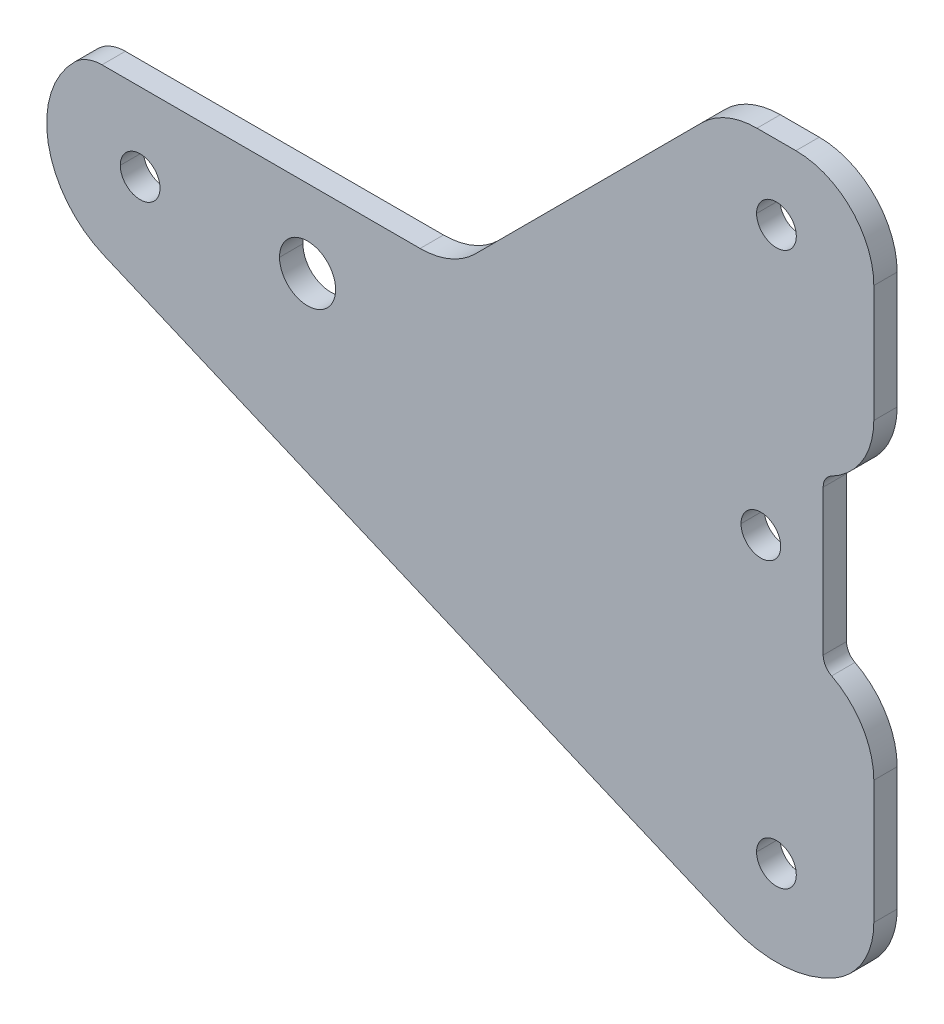
ISO-10303-21;
HEADER;
FILE_DESCRIPTION(('STEP AP214'),'2;1');
FILE_NAME('part.step','',(''),(''),'','','');
FILE_SCHEMA(('AUTOMOTIVE_DESIGN { 1 0 10303 214 1 1 1 1 }'));
ENDSEC;
DATA;
#1=APPLICATION_CONTEXT('core data for automotive mechanical design processes');
#2=APPLICATION_PROTOCOL_DEFINITION('international standard','automotive_design',2000,#1);
#3=PRODUCT_CONTEXT('',#1,'mechanical');
#4=PRODUCT('Part','Part','',(#3));
#5=PRODUCT_RELATED_PRODUCT_CATEGORY('part','',(#4));
#6=PRODUCT_DEFINITION_FORMATION('','',#4);
#7=PRODUCT_DEFINITION_CONTEXT('part definition',#1,'design');
#8=PRODUCT_DEFINITION('design','',#6,#7);
#9=PRODUCT_DEFINITION_SHAPE('','',#8);
#10=(LENGTH_UNIT() NAMED_UNIT(*) SI_UNIT(.MILLI.,.METRE.));
#11=(NAMED_UNIT(*) PLANE_ANGLE_UNIT() SI_UNIT($,.RADIAN.));
#12=(NAMED_UNIT(*) SI_UNIT($,.STERADIAN.) SOLID_ANGLE_UNIT());
#13=UNCERTAINTY_MEASURE_WITH_UNIT(LENGTH_MEASURE(1.E-05),#10,'distance_accuracy_value','');
#14=(GEOMETRIC_REPRESENTATION_CONTEXT(3) GLOBAL_UNCERTAINTY_ASSIGNED_CONTEXT((#13)) GLOBAL_UNIT_ASSIGNED_CONTEXT((#10,
#11,#12)) REPRESENTATION_CONTEXT('',''));
#15=CARTESIAN_POINT('',(0.,0.,0.));
#16=DIRECTION('',(0.,0.,1.));
#17=DIRECTION('',(1.,0.,0.));
#18=AXIS2_PLACEMENT_3D('',#15,#16,#17);
#19=CARTESIAN_POINT('',(0.,35.5,-3.));
#20=DIRECTION('',(0.,0.,1.));
#21=DIRECTION('',(1.,0.,0.));
#22=AXIS2_PLACEMENT_3D('',#19,#20,#21);
#23=CYLINDRICAL_SURFACE('',#22,2.55);
#24=DIRECTION('',(0.,0.,1.));
#25=VECTOR('',#24,1.);
#26=CARTESIAN_POINT('',(-2.55,35.5,-3.));
#27=LINE('',#26,#25);
#28=CARTESIAN_POINT('',(-2.55,35.5,-3.));
#29=VERTEX_POINT('',#28);
#30=CARTESIAN_POINT('',(-2.55,35.5,0.));
#31=VERTEX_POINT('',#30);
#32=EDGE_CURVE('E515',#29,#31,#27,.T.);
#33=ORIENTED_EDGE('',*,*,#32,.F.);
#34=CARTESIAN_POINT('',(0.,35.5,-3.));
#35=DIRECTION('',(0.,0.,1.));
#36=DIRECTION('',(1.,0.,0.));
#37=AXIS2_PLACEMENT_3D('',#34,#35,#36);
#38=CIRCLE('',#37,2.55);
#39=CARTESIAN_POINT('',(2.55,35.5,-3.));
#40=VERTEX_POINT('',#39);
#41=EDGE_CURVE('E265',#40,#29,#38,.T.);
#42=ORIENTED_EDGE('',*,*,#41,.F.);
#43=DIRECTION('',(0.,0.,1.));
#44=VECTOR('',#43,1.);
#45=CARTESIAN_POINT('',(2.55,35.5,-3.));
#46=LINE('',#45,#44);
#47=CARTESIAN_POINT('',(2.55,35.5,0.));
#48=VERTEX_POINT('',#47);
#49=EDGE_CURVE('E514',#40,#48,#46,.T.);
#50=ORIENTED_EDGE('',*,*,#49,.T.);
#51=CARTESIAN_POINT('',(0.,35.5,0.));
#52=DIRECTION('',(0.,0.,1.));
#53=DIRECTION('',(1.,0.,0.));
#54=AXIS2_PLACEMENT_3D('',#51,#52,#53);
#55=CIRCLE('',#54,2.55);
#56=EDGE_CURVE('E270',#48,#31,#55,.T.);
#57=ORIENTED_EDGE('',*,*,#56,.T.);
#58=EDGE_LOOP('',(#33,#42,#50,#57));
#59=FACE_BOUND('',#58,.T.);
#60=ADVANCED_FACE('F17',(#59),#23,.F.);
#61=CARTESIAN_POINT('',(-2.,0.,-3.));
#62=DIRECTION('',(0.,0.,1.));
#63=DIRECTION('',(1.,0.,0.));
#64=AXIS2_PLACEMENT_3D('',#61,#62,#63);
#65=CYLINDRICAL_SURFACE('',#64,2.55);
#66=DIRECTION('',(0.,0.,1.));
#67=VECTOR('',#66,1.);
#68=CARTESIAN_POINT('',(-4.55,0.,-3.));
#69=LINE('',#68,#67);
#70=CARTESIAN_POINT('',(-4.55,0.,-3.));
#71=VERTEX_POINT('',#70);
#72=CARTESIAN_POINT('',(-4.55,0.,0.));
#73=VERTEX_POINT('',#72);
#74=EDGE_CURVE('E479',#71,#73,#69,.T.);
#75=ORIENTED_EDGE('',*,*,#74,.F.);
#76=CARTESIAN_POINT('',(-2.,0.,-3.));
#77=DIRECTION('',(0.,0.,1.));
#78=DIRECTION('',(1.,0.,0.));
#79=AXIS2_PLACEMENT_3D('',#76,#77,#78);
#80=CIRCLE('',#79,2.55);
#81=CARTESIAN_POINT('',(0.55,0.,-3.));
#82=VERTEX_POINT('',#81);
#83=EDGE_CURVE('E269',#82,#71,#80,.T.);
#84=ORIENTED_EDGE('',*,*,#83,.F.);
#85=DIRECTION('',(0.,0.,1.));
#86=VECTOR('',#85,1.);
#87=CARTESIAN_POINT('',(0.55,0.,-3.));
#88=LINE('',#87,#86);
#89=CARTESIAN_POINT('',(0.55,0.,0.));
#90=VERTEX_POINT('',#89);
#91=EDGE_CURVE('E478',#82,#90,#88,.T.);
#92=ORIENTED_EDGE('',*,*,#91,.T.);
#93=CARTESIAN_POINT('',(-2.,0.,0.));
#94=DIRECTION('',(0.,0.,1.));
#95=DIRECTION('',(1.,0.,0.));
#96=AXIS2_PLACEMENT_3D('',#93,#94,#95);
#97=CIRCLE('',#96,2.55);
#98=EDGE_CURVE('E274',#90,#73,#97,.T.);
#99=ORIENTED_EDGE('',*,*,#98,.T.);
#100=EDGE_LOOP('',(#75,#84,#92,#99));
#101=FACE_BOUND('',#100,.T.);
#102=ADVANCED_FACE('F567',(#101),#65,.F.);
#103=CARTESIAN_POINT('',(-81.7,0.,-3.));
#104=DIRECTION('',(0.,0.,1.));
#105=DIRECTION('',(1.,0.,0.));
#106=AXIS2_PLACEMENT_3D('',#103,#104,#105);
#107=CYLINDRICAL_SURFACE('',#106,2.55);
#108=DIRECTION('',(0.,0.,1.));
#109=VECTOR('',#108,1.);
#110=CARTESIAN_POINT('',(-84.25,0.,-3.));
#111=LINE('',#110,#109);
#112=CARTESIAN_POINT('',(-84.25,0.,-3.));
#113=VERTEX_POINT('',#112);
#114=CARTESIAN_POINT('',(-84.25,0.,0.));
#115=VERTEX_POINT('',#114);
#116=EDGE_CURVE('E480',#113,#115,#111,.T.);
#117=ORIENTED_EDGE('',*,*,#116,.F.);
#118=CARTESIAN_POINT('',(-81.7,0.,-3.));
#119=DIRECTION('',(0.,0.,1.));
#120=DIRECTION('',(1.,0.,0.));
#121=AXIS2_PLACEMENT_3D('',#118,#119,#120);
#122=CIRCLE('',#121,2.55);
#123=CARTESIAN_POINT('',(-79.15,0.,-3.));
#124=VERTEX_POINT('',#123);
#125=EDGE_CURVE('E322',#124,#113,#122,.T.);
#126=ORIENTED_EDGE('',*,*,#125,.F.);
#127=DIRECTION('',(0.,0.,1.));
#128=VECTOR('',#127,1.);
#129=CARTESIAN_POINT('',(-79.15,0.,-3.));
#130=LINE('',#129,#128);
#131=CARTESIAN_POINT('',(-79.15,0.,0.));
#132=VERTEX_POINT('',#131);
#133=EDGE_CURVE('E308',#124,#132,#130,.T.);
#134=ORIENTED_EDGE('',*,*,#133,.T.);
#135=CARTESIAN_POINT('',(-81.7,0.,0.));
#136=DIRECTION('',(0.,0.,1.));
#137=DIRECTION('',(1.,0.,0.));
#138=AXIS2_PLACEMENT_3D('',#135,#136,#137);
#139=CIRCLE('',#138,2.55);
#140=EDGE_CURVE('E276',#132,#115,#139,.T.);
#141=ORIENTED_EDGE('',*,*,#140,.T.);
#142=EDGE_LOOP('',(#117,#126,#134,#141));
#143=FACE_BOUND('',#142,.T.);
#144=ADVANCED_FACE('F918',(#143),#107,.F.);
#145=CARTESIAN_POINT('',(-60.2,0.,-3.));
#146=DIRECTION('',(0.,0.,1.));
#147=DIRECTION('',(1.,0.,0.));
#148=AXIS2_PLACEMENT_3D('',#145,#146,#147);
#149=CYLINDRICAL_SURFACE('',#148,3.6);
#150=DIRECTION('',(0.,0.,1.));
#151=VECTOR('',#150,1.);
#152=CARTESIAN_POINT('',(-63.8,0.,-3.));
#153=LINE('',#152,#151);
#154=CARTESIAN_POINT('',(-63.8,0.,-3.));
#155=VERTEX_POINT('',#154);
#156=CARTESIAN_POINT('',(-63.8,0.,0.));
#157=VERTEX_POINT('',#156);
#158=EDGE_CURVE('E289',#155,#157,#153,.T.);
#159=ORIENTED_EDGE('',*,*,#158,.F.);
#160=CARTESIAN_POINT('',(-60.2,0.,-3.));
#161=DIRECTION('',(0.,0.,1.));
#162=DIRECTION('',(1.,0.,0.));
#163=AXIS2_PLACEMENT_3D('',#160,#161,#162);
#164=CIRCLE('',#163,3.6);
#165=CARTESIAN_POINT('',(-56.6,0.,-3.));
#166=VERTEX_POINT('',#165);
#167=EDGE_CURVE('E369',#166,#155,#164,.T.);
#168=ORIENTED_EDGE('',*,*,#167,.F.);
#169=DIRECTION('',(0.,0.,1.));
#170=VECTOR('',#169,1.);
#171=CARTESIAN_POINT('',(-56.6,0.,-3.));
#172=LINE('',#171,#170);
#173=CARTESIAN_POINT('',(-56.6,0.,0.));
#174=VERTEX_POINT('',#173);
#175=EDGE_CURVE('E292',#166,#174,#172,.T.);
#176=ORIENTED_EDGE('',*,*,#175,.T.);
#177=CARTESIAN_POINT('',(-60.2,0.,0.));
#178=DIRECTION('',(0.,0.,1.));
#179=DIRECTION('',(1.,0.,0.));
#180=AXIS2_PLACEMENT_3D('',#177,#178,#179);
#181=CIRCLE('',#180,3.6);
#182=EDGE_CURVE('E25',#174,#157,#181,.T.);
#183=ORIENTED_EDGE('',*,*,#182,.T.);
#184=EDGE_LOOP('',(#159,#168,#176,#183));
#185=FACE_BOUND('',#184,.T.);
#186=ADVANCED_FACE('F286',(#185),#149,.F.);
#187=CARTESIAN_POINT('',(0.,-35.5,-3.));
#188=DIRECTION('',(0.,0.,1.));
#189=DIRECTION('',(1.,0.,0.));
#190=AXIS2_PLACEMENT_3D('',#187,#188,#189);
#191=CYLINDRICAL_SURFACE('',#190,2.55);
#192=DIRECTION('',(0.,0.,1.));
#193=VECTOR('',#192,1.);
#194=CARTESIAN_POINT('',(-2.55,-35.5,-3.));
#195=LINE('',#194,#193);
#196=CARTESIAN_POINT('',(-2.55,-35.5,-3.));
#197=VERTEX_POINT('',#196);
#198=CARTESIAN_POINT('',(-2.55,-35.5,0.));
#199=VERTEX_POINT('',#198);
#200=EDGE_CURVE('E318',#197,#199,#195,.T.);
#201=ORIENTED_EDGE('',*,*,#200,.F.);
#202=CARTESIAN_POINT('',(0.,-35.5,-3.));
#203=DIRECTION('',(0.,0.,1.));
#204=DIRECTION('',(-1.,0.,0.));
#205=AXIS2_PLACEMENT_3D('',#202,#203,#204);
#206=CIRCLE('',#205,2.55);
#207=CARTESIAN_POINT('',(2.55,-35.5,-3.));
#208=VERTEX_POINT('',#207);
#209=EDGE_CURVE('E275',#208,#197,#206,.T.);
#210=ORIENTED_EDGE('',*,*,#209,.F.);
#211=DIRECTION('',(0.,0.,1.));
#212=VECTOR('',#211,1.);
#213=CARTESIAN_POINT('',(2.55,-35.5,-3.));
#214=LINE('',#213,#212);
#215=CARTESIAN_POINT('',(2.55,-35.5,0.));
#216=VERTEX_POINT('',#215);
#217=EDGE_CURVE('E335',#208,#216,#214,.T.);
#218=ORIENTED_EDGE('',*,*,#217,.T.);
#219=CARTESIAN_POINT('',(0.,-35.5,0.));
#220=DIRECTION('',(0.,0.,1.));
#221=DIRECTION('',(-1.,0.,0.));
#222=AXIS2_PLACEMENT_3D('',#219,#220,#221);
#223=CIRCLE('',#222,2.55);
#224=EDGE_CURVE('E11',#216,#199,#223,.T.);
#225=ORIENTED_EDGE('',*,*,#224,.T.);
#226=EDGE_LOOP('',(#201,#210,#218,#225));
#227=FACE_BOUND('',#226,.T.);
#228=ADVANCED_FACE('F870',(#227),#191,.F.);
#229=CARTESIAN_POINT('',(2.49999999999994,35.,0.));
#230=DIRECTION('',(0.,0.,1.));
#231=DIRECTION('',(1.,0.,0.));
#232=AXIS2_PLACEMENT_3D('',#229,#230,#231);
#233=PLANE('',#232);
#234=ORIENTED_EDGE('',*,*,#224,.F.);
#235=CARTESIAN_POINT('',(0.,-35.5,0.));
#236=DIRECTION('',(0.,0.,1.));
#237=DIRECTION('',(-1.,0.,0.));
#238=AXIS2_PLACEMENT_3D('',#235,#236,#237);
#239=CIRCLE('',#238,2.55);
#240=EDGE_CURVE('E331',#199,#216,#239,.T.);
#241=ORIENTED_EDGE('',*,*,#240,.F.);
#242=EDGE_LOOP('',(#234,#241));
#243=FACE_BOUND('',#242,.T.);
#244=ORIENTED_EDGE('',*,*,#182,.F.);
#245=CARTESIAN_POINT('',(-60.2,0.,0.));
#246=DIRECTION('',(0.,0.,1.));
#247=DIRECTION('',(1.,0.,0.));
#248=AXIS2_PLACEMENT_3D('',#245,#246,#247);
#249=CIRCLE('',#248,3.6);
#250=EDGE_CURVE('E295',#157,#174,#249,.T.);
#251=ORIENTED_EDGE('',*,*,#250,.F.);
#252=EDGE_LOOP('',(#244,#251));
#253=FACE_BOUND('',#252,.T.);
#254=ORIENTED_EDGE('',*,*,#140,.F.);
#255=CARTESIAN_POINT('',(-81.7,0.,0.));
#256=DIRECTION('',(0.,0.,1.));
#257=DIRECTION('',(1.,0.,0.));
#258=AXIS2_PLACEMENT_3D('',#255,#256,#257);
#259=CIRCLE('',#258,2.55);
#260=EDGE_CURVE('E483',#115,#132,#259,.T.);
#261=ORIENTED_EDGE('',*,*,#260,.F.);
#262=EDGE_LOOP('',(#254,#261));
#263=FACE_BOUND('',#262,.T.);
#264=ORIENTED_EDGE('',*,*,#98,.F.);
#265=CARTESIAN_POINT('',(-2.,0.,0.));
#266=DIRECTION('',(0.,0.,1.));
#267=DIRECTION('',(1.,0.,0.));
#268=AXIS2_PLACEMENT_3D('',#265,#266,#267);
#269=CIRCLE('',#268,2.55);
#270=EDGE_CURVE('E475',#73,#90,#269,.T.);
#271=ORIENTED_EDGE('',*,*,#270,.F.);
#272=EDGE_LOOP('',(#264,#271));
#273=FACE_BOUND('',#272,.T.);
#274=ORIENTED_EDGE('',*,*,#56,.F.);
#275=CARTESIAN_POINT('',(0.,35.5,0.));
#276=DIRECTION('',(0.,0.,1.));
#277=DIRECTION('',(1.,0.,0.));
#278=AXIS2_PLACEMENT_3D('',#275,#276,#277);
#279=CIRCLE('',#278,2.55);
#280=EDGE_CURVE('E510',#31,#48,#279,.T.);
#281=ORIENTED_EDGE('',*,*,#280,.F.);
#282=EDGE_LOOP('',(#274,#281));
#283=FACE_BOUND('',#282,.T.);
#284=CARTESIAN_POINT('',(2.49999999999994,35.,0.));
#285=DIRECTION('',(0.,0.,1.));
#286=DIRECTION('',(1.,0.,0.));
#287=AXIS2_PLACEMENT_3D('',#284,#285,#286);
#288=CIRCLE('',#287,9.99999999999412);
#289=CARTESIAN_POINT('',(12.4999999999944,35.,0.));
#290=VERTEX_POINT('',#289);
#291=CARTESIAN_POINT('',(2.5,44.9999999999938,0.));
#292=VERTEX_POINT('',#291);
#293=EDGE_CURVE('E339',#290,#292,#288,.T.);
#294=ORIENTED_EDGE('',*,*,#293,.T.);
#295=DIRECTION('',(-1.,0.,0.));
#296=VECTOR('',#295,1.);
#297=CARTESIAN_POINT('',(-2.49999999999994,44.9999999999938,0.));
#298=LINE('',#297,#296);
#299=CARTESIAN_POINT('',(-2.49999999999994,44.9999999999969,0.));
#300=VERTEX_POINT('',#299);
#301=EDGE_CURVE('E52',#292,#300,#298,.T.);
#302=ORIENTED_EDGE('',*,*,#301,.T.);
#303=CARTESIAN_POINT('',(-2.5,35.,0.));
#304=DIRECTION('',(0.,0.,1.));
#305=DIRECTION('',(1.,0.,0.));
#306=AXIS2_PLACEMENT_3D('',#303,#304,#305);
#307=CIRCLE('',#306,9.99999999999692);
#308=CARTESIAN_POINT('',(-9.57522742713172,42.0669057482298,0.));
#309=VERTEX_POINT('',#308);
#310=EDGE_CURVE('E220',#300,#309,#307,.T.);
#311=ORIENTED_EDGE('',*,*,#310,.T.);
#312=DIRECTION('',(-0.706690574822978,-0.707522742713172,0.));
#313=VECTOR('',#312,1.);
#314=CARTESIAN_POINT('',(-38.6747725728683,12.9330942517702,0.));
#315=LINE('',#314,#313);
#316=CARTESIAN_POINT('',(-38.6747725728656,12.9330942517675,0.));
#317=VERTEX_POINT('',#316);
#318=EDGE_CURVE('E224',#309,#317,#315,.T.);
#319=ORIENTED_EDGE('',*,*,#318,.T.);
#320=CARTESIAN_POINT('',(-45.75,20.,0.));
#321=DIRECTION('',(0.,0.,-1.));
#322=DIRECTION('',(1.,0.,0.));
#323=AXIS2_PLACEMENT_3D('',#320,#321,#322);
#324=CIRCLE('',#323,10.0000000000038);
#325=CARTESIAN_POINT('',(-45.75,9.99999999999243,0.));
#326=VERTEX_POINT('',#325);
#327=EDGE_CURVE('E254',#317,#326,#324,.T.);
#328=ORIENTED_EDGE('',*,*,#327,.T.);
#329=DIRECTION('',(-1.,0.,0.));
#330=VECTOR('',#329,1.);
#331=CARTESIAN_POINT('',(-86.5989794855663,9.99999999999276,0.));
#332=LINE('',#331,#330);
#333=CARTESIAN_POINT('',(-86.5989794855663,9.99999999999638,0.));
#334=VERTEX_POINT('',#333);
#335=EDGE_CURVE('E452',#326,#334,#332,.T.);
#336=ORIENTED_EDGE('',*,*,#335,.T.);
#337=CARTESIAN_POINT('',(-86.5989794855664,5.,0.));
#338=DIRECTION('',(0.,0.,1.));
#339=DIRECTION('',(1.,0.,0.));
#340=AXIS2_PLACEMENT_3D('',#337,#338,#339);
#341=CIRCLE('',#340,4.99999999999638);
#342=CARTESIAN_POINT('',(-90.0982505466852,8.57142857142857,0.));
#343=VERTEX_POINT('',#342);
#344=EDGE_CURVE('E440',#334,#343,#341,.T.);
#345=ORIENTED_EDGE('',*,*,#344,.T.);
#346=CARTESIAN_POINT('',(-81.7,0.,0.));
#347=DIRECTION('',(0.,0.,1.));
#348=DIRECTION('',(1.,0.,0.));
#349=AXIS2_PLACEMENT_3D('',#346,#347,#348);
#350=CIRCLE('',#349,12.);
#351=CARTESIAN_POINT('',(-86.3980076205846,-11.0421340508495,0.));
#352=VERTEX_POINT('',#351);
#353=EDGE_CURVE('E377',#343,#352,#350,.T.);
#354=ORIENTED_EDGE('',*,*,#353,.T.);
#355=DIRECTION('',(0.92017783757079,-0.391500635048713,0.));
#356=VECTOR('',#355,1.);
#357=CARTESIAN_POINT('',(-86.3980076205846,-11.0421340508495,0.));
#358=LINE('',#357,#356);
#359=CARTESIAN_POINT('',(-5.8725095257307,-45.3026675635618,0.));
#360=VERTEX_POINT('',#359);
#361=EDGE_CURVE('E326',#352,#360,#358,.T.);
#362=ORIENTED_EDGE('',*,*,#361,.T.);
#363=CARTESIAN_POINT('',(0.,-31.5,0.));
#364=DIRECTION('',(0.,0.,1.));
#365=DIRECTION('',(1.,0.,0.));
#366=AXIS2_PLACEMENT_3D('',#363,#364,#365);
#367=CIRCLE('',#366,15.);
#368=CARTESIAN_POINT('',(7.49999999999869,-44.4903810567643,0.));
#369=VERTEX_POINT('',#368);
#370=EDGE_CURVE('E422',#360,#369,#367,.T.);
#371=ORIENTED_EDGE('',*,*,#370,.T.);
#372=CARTESIAN_POINT('',(2.5,-35.8301270189222,0.));
#373=DIRECTION('',(0.,0.,1.));
#374=DIRECTION('',(1.,0.,0.));
#375=AXIS2_PLACEMENT_3D('',#372,#373,#374);
#376=CIRCLE('',#375,9.99999999999738);
#377=CARTESIAN_POINT('',(12.4999999999948,-35.8301270189221,0.));
#378=VERTEX_POINT('',#377);
#379=EDGE_CURVE('E355',#369,#378,#376,.T.);
#380=ORIENTED_EDGE('',*,*,#379,.T.);
#381=DIRECTION('',(0.,1.,0.));
#382=VECTOR('',#381,1.);
#383=CARTESIAN_POINT('',(12.4999999999948,-35.8301270189221,0.));
#384=LINE('',#383,#382);
#385=CARTESIAN_POINT('',(12.499999999996,-20.,0.));
#386=VERTEX_POINT('',#385);
#387=EDGE_CURVE('E413',#378,#386,#384,.T.);
#388=ORIENTED_EDGE('',*,*,#387,.T.);
#389=CARTESIAN_POINT('',(2.5,-20.,0.));
#390=DIRECTION('',(0.,0.,1.));
#391=DIRECTION('',(-1.,0.,0.));
#392=AXIS2_PLACEMENT_3D('',#389,#390,#391);
#393=CIRCLE('',#392,9.999999999996);
#394=CARTESIAN_POINT('',(7.08333333333352,-11.1121962467906,0.));
#395=VERTEX_POINT('',#394);
#396=EDGE_CURVE('E406',#386,#395,#393,.T.);
#397=ORIENTED_EDGE('',*,*,#396,.T.);
#398=CARTESIAN_POINT('',(8.,-9.33463549614922,0.));
#399=DIRECTION('',(0.,0.,-1.));
#400=DIRECTION('',(1.,0.,0.));
#401=AXIS2_PLACEMENT_3D('',#398,#399,#400);
#402=CIRCLE('',#401,1.99999999999959);
#403=CARTESIAN_POINT('',(6.00000000000349,-9.33463549614922,0.));
#404=VERTEX_POINT('',#403);
#405=EDGE_CURVE('E384',#395,#404,#402,.T.);
#406=ORIENTED_EDGE('',*,*,#405,.T.);
#407=DIRECTION('',(0.,1.,0.));
#408=VECTOR('',#407,1.);
#409=CARTESIAN_POINT('',(6.00000000000349,-9.33463549614922,0.));
#410=LINE('',#409,#408);
#411=CARTESIAN_POINT('',(6.00000000000036,9.33463549614922,0.));
#412=VERTEX_POINT('',#411);
#413=EDGE_CURVE('E390',#404,#412,#410,.T.);
#414=ORIENTED_EDGE('',*,*,#413,.T.);
#415=CARTESIAN_POINT('',(8.,9.33463549614922,0.));
#416=DIRECTION('',(0.,0.,-1.));
#417=DIRECTION('',(1.,0.,0.));
#418=AXIS2_PLACEMENT_3D('',#415,#416,#417);
#419=CIRCLE('',#418,1.99999999999964);
#420=CARTESIAN_POINT('',(7.08333333333142,11.1121962467947,0.));
#421=VERTEX_POINT('',#420);
#422=EDGE_CURVE('E368',#412,#421,#419,.T.);
#423=ORIENTED_EDGE('',*,*,#422,.T.);
#424=CARTESIAN_POINT('',(2.5,20.,0.));
#425=DIRECTION('',(0.,0.,1.));
#426=DIRECTION('',(1.,0.,0.));
#427=AXIS2_PLACEMENT_3D('',#424,#425,#426);
#428=CIRCLE('',#427,9.99999999999584);
#429=CARTESIAN_POINT('',(12.4999999999944,20.,0.));
#430=VERTEX_POINT('',#429);
#431=EDGE_CURVE('E360',#421,#430,#428,.T.);
#432=ORIENTED_EDGE('',*,*,#431,.T.);
#433=DIRECTION('',(0.,1.,0.));
#434=VECTOR('',#433,1.);
#435=CARTESIAN_POINT('',(12.4999999999944,20.,0.));
#436=LINE('',#435,#434);
#437=EDGE_CURVE('E348',#430,#290,#436,.T.);
#438=ORIENTED_EDGE('',*,*,#437,.T.);
#439=EDGE_LOOP('',(#294,#302,#311,#319,#328,#336,#345,#354,#362,#371,#380,#388,#397,#406,#414,
#423,#432,#438));
#440=FACE_BOUND('',#439,.T.);
#441=ADVANCED_FACE('F222',(#243,#253,#263,#273,#283,#440),#233,.T.);
#442=CARTESIAN_POINT('',(2.49999999999994,35.,-3.));
#443=DIRECTION('',(0.,0.,1.));
#444=DIRECTION('',(1.,0.,0.));
#445=AXIS2_PLACEMENT_3D('',#442,#443,#444);
#446=PLANE('',#445);
#447=ORIENTED_EDGE('',*,*,#209,.T.);
#448=CARTESIAN_POINT('',(0.,-35.5,-3.));
#449=DIRECTION('',(0.,0.,1.));
#450=DIRECTION('',(-1.,0.,0.));
#451=AXIS2_PLACEMENT_3D('',#448,#449,#450);
#452=CIRCLE('',#451,2.55);
#453=EDGE_CURVE('E314',#197,#208,#452,.T.);
#454=ORIENTED_EDGE('',*,*,#453,.T.);
#455=EDGE_LOOP('',(#447,#454));
#456=FACE_BOUND('',#455,.T.);
#457=ORIENTED_EDGE('',*,*,#167,.T.);
#458=CARTESIAN_POINT('',(-60.2,0.,-3.));
#459=DIRECTION('',(0.,0.,1.));
#460=DIRECTION('',(1.,0.,0.));
#461=AXIS2_PLACEMENT_3D('',#458,#459,#460);
#462=CIRCLE('',#461,3.6);
#463=EDGE_CURVE('E302',#155,#166,#462,.T.);
#464=ORIENTED_EDGE('',*,*,#463,.T.);
#465=EDGE_LOOP('',(#457,#464));
#466=FACE_BOUND('',#465,.T.);
#467=ORIENTED_EDGE('',*,*,#125,.T.);
#468=CARTESIAN_POINT('',(-81.7,0.,-3.));
#469=DIRECTION('',(0.,0.,1.));
#470=DIRECTION('',(1.,0.,0.));
#471=AXIS2_PLACEMENT_3D('',#468,#469,#470);
#472=CIRCLE('',#471,2.55);
#473=EDGE_CURVE('E484',#113,#124,#472,.T.);
#474=ORIENTED_EDGE('',*,*,#473,.T.);
#475=EDGE_LOOP('',(#467,#474));
#476=FACE_BOUND('',#475,.T.);
#477=ORIENTED_EDGE('',*,*,#83,.T.);
#478=CARTESIAN_POINT('',(-2.,0.,-3.));
#479=DIRECTION('',(0.,0.,1.));
#480=DIRECTION('',(1.,0.,0.));
#481=AXIS2_PLACEMENT_3D('',#478,#479,#480);
#482=CIRCLE('',#481,2.55);
#483=EDGE_CURVE('E536',#71,#82,#482,.T.);
#484=ORIENTED_EDGE('',*,*,#483,.T.);
#485=EDGE_LOOP('',(#477,#484));
#486=FACE_BOUND('',#485,.T.);
#487=ORIENTED_EDGE('',*,*,#41,.T.);
#488=CARTESIAN_POINT('',(0.,35.5,-3.));
#489=DIRECTION('',(0.,0.,1.));
#490=DIRECTION('',(1.,0.,0.));
#491=AXIS2_PLACEMENT_3D('',#488,#489,#490);
#492=CIRCLE('',#491,2.55);
#493=EDGE_CURVE('E521',#29,#40,#492,.T.);
#494=ORIENTED_EDGE('',*,*,#493,.T.);
#495=EDGE_LOOP('',(#487,#494));
#496=FACE_BOUND('',#495,.T.);
#497=CARTESIAN_POINT('',(2.49999999999994,35.,-3.));
#498=DIRECTION('',(0.,0.,1.));
#499=DIRECTION('',(1.,0.,0.));
#500=AXIS2_PLACEMENT_3D('',#497,#498,#499);
#501=CIRCLE('',#500,9.99999999999412);
#502=CARTESIAN_POINT('',(12.4999999999944,35.,-3.));
#503=VERTEX_POINT('',#502);
#504=CARTESIAN_POINT('',(2.5,44.9999999999938,-3.));
#505=VERTEX_POINT('',#504);
#506=EDGE_CURVE('E311',#503,#505,#501,.T.);
#507=ORIENTED_EDGE('',*,*,#506,.F.);
#508=DIRECTION('',(0.,1.,0.));
#509=VECTOR('',#508,1.);
#510=CARTESIAN_POINT('',(12.4999999999944,20.,-3.));
#511=LINE('',#510,#509);
#512=CARTESIAN_POINT('',(12.4999999999944,20.,-3.));
#513=VERTEX_POINT('',#512);
#514=EDGE_CURVE('E357',#513,#503,#511,.T.);
#515=ORIENTED_EDGE('',*,*,#514,.F.);
#516=CARTESIAN_POINT('',(2.5,20.,-3.));
#517=DIRECTION('',(0.,0.,1.));
#518=DIRECTION('',(1.,0.,0.));
#519=AXIS2_PLACEMENT_3D('',#516,#517,#518);
#520=CIRCLE('',#519,9.99999999999584);
#521=CARTESIAN_POINT('',(7.08333333333142,11.1121962467947,-3.));
#522=VERTEX_POINT('',#521);
#523=EDGE_CURVE('E365',#522,#513,#520,.T.);
#524=ORIENTED_EDGE('',*,*,#523,.F.);
#525=CARTESIAN_POINT('',(8.,9.33463549614922,-3.));
#526=DIRECTION('',(0.,0.,-1.));
#527=DIRECTION('',(1.,0.,0.));
#528=AXIS2_PLACEMENT_3D('',#525,#526,#527);
#529=CIRCLE('',#528,1.99999999999964);
#530=CARTESIAN_POINT('',(6.00000000000036,9.33463549614922,-3.));
#531=VERTEX_POINT('',#530);
#532=EDGE_CURVE('E389',#531,#522,#529,.T.);
#533=ORIENTED_EDGE('',*,*,#532,.F.);
#534=DIRECTION('',(0.,1.,0.));
#535=VECTOR('',#534,1.);
#536=CARTESIAN_POINT('',(6.00000000000349,-9.33463549614922,-3.));
#537=LINE('',#536,#535);
#538=CARTESIAN_POINT('',(6.00000000000349,-9.33463549614922,-3.));
#539=VERTEX_POINT('',#538);
#540=EDGE_CURVE('E381',#539,#531,#537,.T.);
#541=ORIENTED_EDGE('',*,*,#540,.F.);
#542=CARTESIAN_POINT('',(8.,-9.33463549614922,-3.));
#543=DIRECTION('',(0.,0.,-1.));
#544=DIRECTION('',(1.,0.,0.));
#545=AXIS2_PLACEMENT_3D('',#542,#543,#544);
#546=CIRCLE('',#545,1.99999999999959);
#547=CARTESIAN_POINT('',(7.08333333333352,-11.1121962467906,-3.));
#548=VERTEX_POINT('',#547);
#549=EDGE_CURVE('E402',#548,#539,#546,.T.);
#550=ORIENTED_EDGE('',*,*,#549,.F.);
#551=CARTESIAN_POINT('',(2.5,-20.,-3.));
#552=DIRECTION('',(0.,0.,1.));
#553=DIRECTION('',(-1.,0.,0.));
#554=AXIS2_PLACEMENT_3D('',#551,#552,#553);
#555=CIRCLE('',#554,9.999999999996);
#556=CARTESIAN_POINT('',(12.499999999996,-20.,-3.));
#557=VERTEX_POINT('',#556);
#558=EDGE_CURVE('E410',#557,#548,#555,.T.);
#559=ORIENTED_EDGE('',*,*,#558,.F.);
#560=DIRECTION('',(0.,1.,0.));
#561=VECTOR('',#560,1.);
#562=CARTESIAN_POINT('',(12.4999999999948,-35.8301270189221,-3.));
#563=LINE('',#562,#561);
#564=CARTESIAN_POINT('',(12.4999999999948,-35.8301270189221,-3.));
#565=VERTEX_POINT('',#564);
#566=EDGE_CURVE('E352',#565,#557,#563,.T.);
#567=ORIENTED_EDGE('',*,*,#566,.F.);
#568=CARTESIAN_POINT('',(2.5,-35.8301270189222,-3.));
#569=DIRECTION('',(0.,0.,1.));
#570=DIRECTION('',(1.,0.,0.));
#571=AXIS2_PLACEMENT_3D('',#568,#569,#570);
#572=CIRCLE('',#571,9.99999999999738);
#573=CARTESIAN_POINT('',(7.49999999999869,-44.4903810567643,-3.));
#574=VERTEX_POINT('',#573);
#575=EDGE_CURVE('E419',#574,#565,#572,.T.);
#576=ORIENTED_EDGE('',*,*,#575,.F.);
#577=CARTESIAN_POINT('',(0.,-31.5,-3.));
#578=DIRECTION('',(0.,0.,1.));
#579=DIRECTION('',(1.,0.,0.));
#580=AXIS2_PLACEMENT_3D('',#577,#578,#579);
#581=CIRCLE('',#580,15.);
#582=CARTESIAN_POINT('',(-5.8725095257307,-45.3026675635618,-3.));
#583=VERTEX_POINT('',#582);
#584=EDGE_CURVE('E323',#583,#574,#581,.T.);
#585=ORIENTED_EDGE('',*,*,#584,.F.);
#586=DIRECTION('',(0.92017783757079,-0.391500635048713,0.));
#587=VECTOR('',#586,1.);
#588=CARTESIAN_POINT('',(-86.3980076205846,-11.0421340508495,-3.));
#589=LINE('',#588,#587);
#590=CARTESIAN_POINT('',(-86.3980076205846,-11.0421340508495,-3.));
#591=VERTEX_POINT('',#590);
#592=EDGE_CURVE('E433',#591,#583,#589,.T.);
#593=ORIENTED_EDGE('',*,*,#592,.F.);
#594=CARTESIAN_POINT('',(-81.7,0.,-3.));
#595=DIRECTION('',(0.,0.,1.));
#596=DIRECTION('',(1.,0.,0.));
#597=AXIS2_PLACEMENT_3D('',#594,#595,#596);
#598=CIRCLE('',#597,12.);
#599=CARTESIAN_POINT('',(-90.0982505466852,8.57142857142857,-3.));
#600=VERTEX_POINT('',#599);
#601=EDGE_CURVE('E376',#600,#591,#598,.T.);
#602=ORIENTED_EDGE('',*,*,#601,.F.);
#603=CARTESIAN_POINT('',(-86.5989794855664,5.,-3.));
#604=DIRECTION('',(0.,0.,1.));
#605=DIRECTION('',(1.,0.,0.));
#606=AXIS2_PLACEMENT_3D('',#603,#604,#605);
#607=CIRCLE('',#606,4.99999999999638);
#608=CARTESIAN_POINT('',(-86.5989794855663,9.99999999999638,-3.));
#609=VERTEX_POINT('',#608);
#610=EDGE_CURVE('E449',#609,#600,#607,.T.);
#611=ORIENTED_EDGE('',*,*,#610,.F.);
#612=DIRECTION('',(-1.,0.,0.));
#613=VECTOR('',#612,1.);
#614=CARTESIAN_POINT('',(-86.5989794855663,9.99999999999276,-3.));
#615=LINE('',#614,#613);
#616=CARTESIAN_POINT('',(-45.75,9.99999999999243,-3.));
#617=VERTEX_POINT('',#616);
#618=EDGE_CURVE('E453',#617,#609,#615,.T.);
#619=ORIENTED_EDGE('',*,*,#618,.F.);
#620=CARTESIAN_POINT('',(-45.75,20.,-3.));
#621=DIRECTION('',(0.,0.,-1.));
#622=DIRECTION('',(1.,0.,0.));
#623=AXIS2_PLACEMENT_3D('',#620,#621,#622);
#624=CIRCLE('',#623,10.0000000000038);
#625=CARTESIAN_POINT('',(-38.6747725728656,12.9330942517675,-3.));
#626=VERTEX_POINT('',#625);
#627=EDGE_CURVE('E245',#626,#617,#624,.T.);
#628=ORIENTED_EDGE('',*,*,#627,.F.);
#629=DIRECTION('',(-0.706690574822978,-0.707522742713172,0.));
#630=VECTOR('',#629,1.);
#631=CARTESIAN_POINT('',(-38.6747725728683,12.9330942517702,-3.));
#632=LINE('',#631,#630);
#633=CARTESIAN_POINT('',(-9.57522742713172,42.0669057482298,-3.));
#634=VERTEX_POINT('',#633);
#635=EDGE_CURVE('E230',#634,#626,#632,.T.);
#636=ORIENTED_EDGE('',*,*,#635,.F.);
#637=CARTESIAN_POINT('',(-2.5,35.,-3.));
#638=DIRECTION('',(0.,0.,1.));
#639=DIRECTION('',(1.,0.,0.));
#640=AXIS2_PLACEMENT_3D('',#637,#638,#639);
#641=CIRCLE('',#640,9.99999999999692);
#642=CARTESIAN_POINT('',(-2.49999999999994,44.9999999999969,-3.));
#643=VERTEX_POINT('',#642);
#644=EDGE_CURVE('E235',#643,#634,#641,.T.);
#645=ORIENTED_EDGE('',*,*,#644,.F.);
#646=DIRECTION('',(-1.,0.,0.));
#647=VECTOR('',#646,1.);
#648=CARTESIAN_POINT('',(-2.49999999999994,44.9999999999938,-3.));
#649=LINE('',#648,#647);
#650=EDGE_CURVE('E38',#505,#643,#649,.T.);
#651=ORIENTED_EDGE('',*,*,#650,.F.);
#652=EDGE_LOOP('',(#507,#515,#524,#533,#541,#550,#559,#567,#576,#585,#593,#602,#611,#619,#628,
#636,#645,#651));
#653=FACE_BOUND('',#652,.T.);
#654=ADVANCED_FACE('F616',(#456,#466,#476,#486,#496,#653),#446,.F.);
#655=CARTESIAN_POINT('',(-2.49999999999994,44.9999999999938,-3.));
#656=DIRECTION('',(0.,1.,0.));
#657=DIRECTION('',(1.,0.,0.));
#658=AXIS2_PLACEMENT_3D('',#655,#656,#657);
#659=PLANE('',#658);
#660=ORIENTED_EDGE('',*,*,#301,.F.);
#661=DIRECTION('',(0.,0.,1.));
#662=VECTOR('',#661,1.);
#663=CARTESIAN_POINT('',(2.5,44.9999999999938,-3.));
#664=LINE('',#663,#662);
#665=EDGE_CURVE('E344',#505,#292,#664,.T.);
#666=ORIENTED_EDGE('',*,*,#665,.F.);
#667=ORIENTED_EDGE('',*,*,#650,.T.);
#668=DIRECTION('',(0.,0.,1.));
#669=VECTOR('',#668,1.);
#670=CARTESIAN_POINT('',(-2.49999999999994,44.9999999999969,-3.));
#671=LINE('',#670,#669);
#672=EDGE_CURVE('E229',#643,#300,#671,.T.);
#673=ORIENTED_EDGE('',*,*,#672,.T.);
#674=EDGE_LOOP('',(#660,#666,#667,#673));
#675=FACE_BOUND('',#674,.T.);
#676=ADVANCED_FACE('F749',(#675),#659,.T.);
#677=CARTESIAN_POINT('',(-2.5,35.,-3.));
#678=DIRECTION('',(0.,0.,1.));
#679=DIRECTION('',(1.,0.,0.));
#680=AXIS2_PLACEMENT_3D('',#677,#678,#679);
#681=CYLINDRICAL_SURFACE('',#680,9.99999999999692);
#682=ORIENTED_EDGE('',*,*,#310,.F.);
#683=ORIENTED_EDGE('',*,*,#672,.F.);
#684=ORIENTED_EDGE('',*,*,#644,.T.);
#685=DIRECTION('',(0.,0.,1.));
#686=VECTOR('',#685,1.);
#687=CARTESIAN_POINT('',(-9.57522742713172,42.0669057482298,-3.));
#688=LINE('',#687,#686);
#689=EDGE_CURVE('E233',#634,#309,#688,.T.);
#690=ORIENTED_EDGE('',*,*,#689,.T.);
#691=EDGE_LOOP('',(#682,#683,#684,#690));
#692=FACE_BOUND('',#691,.T.);
#693=ADVANCED_FACE('F234',(#692),#681,.T.);
#694=CARTESIAN_POINT('',(-38.6747725728683,12.9330942517702,-3.));
#695=DIRECTION('',(-0.707522742713172,0.706690574822978,0.));
#696=DIRECTION('',(0.,0.,1.));
#697=AXIS2_PLACEMENT_3D('',#694,#695,#696);
#698=PLANE('',#697);
#699=ORIENTED_EDGE('',*,*,#318,.F.);
#700=ORIENTED_EDGE('',*,*,#689,.F.);
#701=ORIENTED_EDGE('',*,*,#635,.T.);
#702=DIRECTION('',(0.,0.,1.));
#703=VECTOR('',#702,1.);
#704=CARTESIAN_POINT('',(-38.6747725728656,12.9330942517675,-3.));
#705=LINE('',#704,#703);
#706=EDGE_CURVE('E242',#626,#317,#705,.T.);
#707=ORIENTED_EDGE('',*,*,#706,.T.);
#708=EDGE_LOOP('',(#699,#700,#701,#707));
#709=FACE_BOUND('',#708,.T.);
#710=ADVANCED_FACE('F240',(#709),#698,.T.);
#711=CARTESIAN_POINT('',(-45.75,20.,-3.));
#712=DIRECTION('',(0.,0.,1.));
#713=DIRECTION('',(1.,0.,0.));
#714=AXIS2_PLACEMENT_3D('',#711,#712,#713);
#715=CYLINDRICAL_SURFACE('',#714,10.0000000000038);
#716=ORIENTED_EDGE('',*,*,#327,.F.);
#717=ORIENTED_EDGE('',*,*,#706,.F.);
#718=ORIENTED_EDGE('',*,*,#627,.T.);
#719=DIRECTION('',(0.,0.,1.));
#720=VECTOR('',#719,1.);
#721=CARTESIAN_POINT('',(-45.75,9.99999999999243,-3.));
#722=LINE('',#721,#720);
#723=EDGE_CURVE('E455',#617,#326,#722,.T.);
#724=ORIENTED_EDGE('',*,*,#723,.T.);
#725=EDGE_LOOP('',(#716,#717,#718,#724));
#726=FACE_BOUND('',#725,.T.);
#727=ADVANCED_FACE('F657',(#726),#715,.F.);
#728=CARTESIAN_POINT('',(-86.5989794855663,9.99999999999276,-3.));
#729=DIRECTION('',(0.,1.,0.));
#730=DIRECTION('',(1.,0.,0.));
#731=AXIS2_PLACEMENT_3D('',#728,#729,#730);
#732=PLANE('',#731);
#733=ORIENTED_EDGE('',*,*,#335,.F.);
#734=ORIENTED_EDGE('',*,*,#723,.F.);
#735=ORIENTED_EDGE('',*,*,#618,.T.);
#736=DIRECTION('',(0.,0.,1.));
#737=VECTOR('',#736,1.);
#738=CARTESIAN_POINT('',(-86.5989794855663,9.99999999999638,-3.));
#739=LINE('',#738,#737);
#740=EDGE_CURVE('E445',#609,#334,#739,.T.);
#741=ORIENTED_EDGE('',*,*,#740,.T.);
#742=EDGE_LOOP('',(#733,#734,#735,#741));
#743=FACE_BOUND('',#742,.T.);
#744=ADVANCED_FACE('F656',(#743),#732,.T.);
#745=CARTESIAN_POINT('',(-86.5989794855664,5.,-3.));
#746=DIRECTION('',(0.,0.,1.));
#747=DIRECTION('',(1.,0.,0.));
#748=AXIS2_PLACEMENT_3D('',#745,#746,#747);
#749=CYLINDRICAL_SURFACE('',#748,4.99999999999638);
#750=ORIENTED_EDGE('',*,*,#344,.F.);
#751=ORIENTED_EDGE('',*,*,#740,.F.);
#752=ORIENTED_EDGE('',*,*,#610,.T.);
#753=DIRECTION('',(0.,0.,1.));
#754=VECTOR('',#753,1.);
#755=CARTESIAN_POINT('',(-90.0982505466852,8.57142857142857,-3.));
#756=LINE('',#755,#754);
#757=EDGE_CURVE('E372',#600,#343,#756,.T.);
#758=ORIENTED_EDGE('',*,*,#757,.T.);
#759=EDGE_LOOP('',(#750,#751,#752,#758));
#760=FACE_BOUND('',#759,.T.);
#761=ADVANCED_FACE('F653',(#760),#749,.T.);
#762=CARTESIAN_POINT('',(-81.7,0.,-3.));
#763=DIRECTION('',(0.,0.,1.));
#764=DIRECTION('',(1.,0.,0.));
#765=AXIS2_PLACEMENT_3D('',#762,#763,#764);
#766=CYLINDRICAL_SURFACE('',#765,12.);
#767=ORIENTED_EDGE('',*,*,#353,.F.);
#768=ORIENTED_EDGE('',*,*,#757,.F.);
#769=ORIENTED_EDGE('',*,*,#601,.T.);
#770=DIRECTION('',(0.,0.,1.));
#771=VECTOR('',#770,1.);
#772=CARTESIAN_POINT('',(-86.3980076205846,-11.0421340508495,-3.));
#773=LINE('',#772,#771);
#774=EDGE_CURVE('E429',#591,#352,#773,.T.);
#775=ORIENTED_EDGE('',*,*,#774,.T.);
#776=EDGE_LOOP('',(#767,#768,#769,#775));
#777=FACE_BOUND('',#776,.T.);
#778=ADVANCED_FACE('F650',(#777),#766,.T.);
#779=CARTESIAN_POINT('',(-86.3980076205846,-11.0421340508495,-3.));
#780=DIRECTION('',(-0.391500635048713,-0.92017783757079,0.));
#781=DIRECTION('',(-0.92017783757079,0.391500635048713,0.));
#782=AXIS2_PLACEMENT_3D('',#779,#780,#781);
#783=PLANE('',#782);
#784=ORIENTED_EDGE('',*,*,#361,.F.);
#785=ORIENTED_EDGE('',*,*,#774,.F.);
#786=ORIENTED_EDGE('',*,*,#592,.T.);
#787=DIRECTION('',(0.,0.,1.));
#788=VECTOR('',#787,1.);
#789=CARTESIAN_POINT('',(-5.8725095257307,-45.3026675635618,-3.));
#790=LINE('',#789,#788);
#791=EDGE_CURVE('E327',#583,#360,#790,.T.);
#792=ORIENTED_EDGE('',*,*,#791,.T.);
#793=EDGE_LOOP('',(#784,#785,#786,#792));
#794=FACE_BOUND('',#793,.T.);
#795=ADVANCED_FACE('F647',(#794),#783,.T.);
#796=CARTESIAN_POINT('',(0.,-31.5,-3.));
#797=DIRECTION('',(0.,0.,1.));
#798=DIRECTION('',(1.,0.,0.));
#799=AXIS2_PLACEMENT_3D('',#796,#797,#798);
#800=CYLINDRICAL_SURFACE('',#799,15.);
#801=ORIENTED_EDGE('',*,*,#370,.F.);
#802=ORIENTED_EDGE('',*,*,#791,.F.);
#803=ORIENTED_EDGE('',*,*,#584,.T.);
#804=DIRECTION('',(0.,0.,1.));
#805=VECTOR('',#804,1.);
#806=CARTESIAN_POINT('',(7.49999999999869,-44.4903810567643,-3.));
#807=LINE('',#806,#805);
#808=EDGE_CURVE('E423',#574,#369,#807,.T.);
#809=ORIENTED_EDGE('',*,*,#808,.T.);
#810=EDGE_LOOP('',(#801,#802,#803,#809));
#811=FACE_BOUND('',#810,.T.);
#812=ADVANCED_FACE('F639',(#811),#800,.T.);
#813=CARTESIAN_POINT('',(2.5,-35.8301270189222,-3.));
#814=DIRECTION('',(0.,0.,1.));
#815=DIRECTION('',(1.,0.,0.));
#816=AXIS2_PLACEMENT_3D('',#813,#814,#815);
#817=CYLINDRICAL_SURFACE('',#816,9.99999999999738);
#818=ORIENTED_EDGE('',*,*,#379,.F.);
#819=ORIENTED_EDGE('',*,*,#808,.F.);
#820=ORIENTED_EDGE('',*,*,#575,.T.);
#821=DIRECTION('',(0.,0.,1.));
#822=VECTOR('',#821,1.);
#823=CARTESIAN_POINT('',(12.4999999999948,-35.8301270189221,-3.));
#824=LINE('',#823,#822);
#825=EDGE_CURVE('E356',#565,#378,#824,.T.);
#826=ORIENTED_EDGE('',*,*,#825,.T.);
#827=EDGE_LOOP('',(#818,#819,#820,#826));
#828=FACE_BOUND('',#827,.T.);
#829=ADVANCED_FACE('F636',(#828),#817,.T.);
#830=CARTESIAN_POINT('',(12.4999999999948,-35.8301270189221,-3.));
#831=DIRECTION('',(1.,0.,0.));
#832=DIRECTION('',(0.,1.,0.));
#833=AXIS2_PLACEMENT_3D('',#830,#831,#832);
#834=PLANE('',#833);
#835=ORIENTED_EDGE('',*,*,#387,.F.);
#836=ORIENTED_EDGE('',*,*,#825,.F.);
#837=ORIENTED_EDGE('',*,*,#566,.T.);
#838=DIRECTION('',(0.,0.,1.));
#839=VECTOR('',#838,1.);
#840=CARTESIAN_POINT('',(12.499999999996,-20.,-3.));
#841=LINE('',#840,#839);
#842=EDGE_CURVE('E409',#557,#386,#841,.T.);
#843=ORIENTED_EDGE('',*,*,#842,.T.);
#844=EDGE_LOOP('',(#835,#836,#837,#843));
#845=FACE_BOUND('',#844,.T.);
#846=ADVANCED_FACE('F633',(#845),#834,.T.);
#847=CARTESIAN_POINT('',(2.5,-20.,-3.));
#848=DIRECTION('',(0.,0.,1.));
#849=DIRECTION('',(1.,0.,0.));
#850=AXIS2_PLACEMENT_3D('',#847,#848,#849);
#851=CYLINDRICAL_SURFACE('',#850,9.999999999996);
#852=ORIENTED_EDGE('',*,*,#396,.F.);
#853=ORIENTED_EDGE('',*,*,#842,.F.);
#854=ORIENTED_EDGE('',*,*,#558,.T.);
#855=DIRECTION('',(0.,0.,1.));
#856=VECTOR('',#855,1.);
#857=CARTESIAN_POINT('',(7.08333333333352,-11.1121962467906,-3.));
#858=LINE('',#857,#856);
#859=EDGE_CURVE('E398',#548,#395,#858,.T.);
#860=ORIENTED_EDGE('',*,*,#859,.T.);
#861=EDGE_LOOP('',(#852,#853,#854,#860));
#862=FACE_BOUND('',#861,.T.);
#863=ADVANCED_FACE('F626',(#862),#851,.T.);
#864=CARTESIAN_POINT('',(8.,-9.33463549614922,-3.));
#865=DIRECTION('',(0.,0.,1.));
#866=DIRECTION('',(1.,0.,0.));
#867=AXIS2_PLACEMENT_3D('',#864,#865,#866);
#868=CYLINDRICAL_SURFACE('',#867,1.99999999999959);
#869=ORIENTED_EDGE('',*,*,#405,.F.);
#870=ORIENTED_EDGE('',*,*,#859,.F.);
#871=ORIENTED_EDGE('',*,*,#549,.T.);
#872=DIRECTION('',(0.,0.,1.));
#873=VECTOR('',#872,1.);
#874=CARTESIAN_POINT('',(6.00000000000349,-9.33463549614922,-3.));
#875=LINE('',#874,#873);
#876=EDGE_CURVE('E385',#539,#404,#875,.T.);
#877=ORIENTED_EDGE('',*,*,#876,.T.);
#878=EDGE_LOOP('',(#869,#870,#871,#877));
#879=FACE_BOUND('',#878,.T.);
#880=ADVANCED_FACE('F609',(#879),#868,.F.);
#881=CARTESIAN_POINT('',(6.00000000000349,-9.33463549614922,-3.));
#882=DIRECTION('',(1.,0.,0.));
#883=DIRECTION('',(0.,1.,0.));
#884=AXIS2_PLACEMENT_3D('',#881,#882,#883);
#885=PLANE('',#884);
#886=ORIENTED_EDGE('',*,*,#413,.F.);
#887=ORIENTED_EDGE('',*,*,#876,.F.);
#888=ORIENTED_EDGE('',*,*,#540,.T.);
#889=DIRECTION('',(0.,0.,1.));
#890=VECTOR('',#889,1.);
#891=CARTESIAN_POINT('',(6.00000000000036,9.33463549614922,-3.));
#892=LINE('',#891,#890);
#893=EDGE_CURVE('E380',#531,#412,#892,.T.);
#894=ORIENTED_EDGE('',*,*,#893,.T.);
#895=EDGE_LOOP('',(#886,#887,#888,#894));
#896=FACE_BOUND('',#895,.T.);
#897=ADVANCED_FACE('F620',(#896),#885,.T.);
#898=CARTESIAN_POINT('',(8.,9.33463549614922,-3.));
#899=DIRECTION('',(0.,0.,1.));
#900=DIRECTION('',(1.,0.,0.));
#901=AXIS2_PLACEMENT_3D('',#898,#899,#900);
#902=CYLINDRICAL_SURFACE('',#901,1.99999999999964);
#903=ORIENTED_EDGE('',*,*,#422,.F.);
#904=ORIENTED_EDGE('',*,*,#893,.F.);
#905=ORIENTED_EDGE('',*,*,#532,.T.);
#906=DIRECTION('',(0.,0.,1.));
#907=VECTOR('',#906,1.);
#908=CARTESIAN_POINT('',(7.08333333333142,11.1121962467947,-3.));
#909=LINE('',#908,#907);
#910=EDGE_CURVE('E361',#522,#421,#909,.T.);
#911=ORIENTED_EDGE('',*,*,#910,.T.);
#912=EDGE_LOOP('',(#903,#904,#905,#911));
#913=FACE_BOUND('',#912,.T.);
#914=ADVANCED_FACE('F841',(#913),#902,.F.);
#915=CARTESIAN_POINT('',(2.5,20.,-3.));
#916=DIRECTION('',(0.,0.,1.));
#917=DIRECTION('',(1.,0.,0.));
#918=AXIS2_PLACEMENT_3D('',#915,#916,#917);
#919=CYLINDRICAL_SURFACE('',#918,9.99999999999584);
#920=ORIENTED_EDGE('',*,*,#431,.F.);
#921=ORIENTED_EDGE('',*,*,#910,.F.);
#922=ORIENTED_EDGE('',*,*,#523,.T.);
#923=DIRECTION('',(0.,0.,1.));
#924=VECTOR('',#923,1.);
#925=CARTESIAN_POINT('',(12.4999999999944,20.,-3.));
#926=LINE('',#925,#924);
#927=EDGE_CURVE('E351',#513,#430,#926,.T.);
#928=ORIENTED_EDGE('',*,*,#927,.T.);
#929=EDGE_LOOP('',(#920,#921,#922,#928));
#930=FACE_BOUND('',#929,.T.);
#931=ADVANCED_FACE('F820',(#930),#919,.T.);
#932=CARTESIAN_POINT('',(12.4999999999944,20.,-3.));
#933=DIRECTION('',(1.,0.,0.));
#934=DIRECTION('',(0.,1.,0.));
#935=AXIS2_PLACEMENT_3D('',#932,#933,#934);
#936=PLANE('',#935);
#937=ORIENTED_EDGE('',*,*,#437,.F.);
#938=ORIENTED_EDGE('',*,*,#927,.F.);
#939=ORIENTED_EDGE('',*,*,#514,.T.);
#940=DIRECTION('',(0.,0.,1.));
#941=VECTOR('',#940,1.);
#942=CARTESIAN_POINT('',(12.4999999999944,35.,-3.));
#943=LINE('',#942,#941);
#944=EDGE_CURVE('E340',#503,#290,#943,.T.);
#945=ORIENTED_EDGE('',*,*,#944,.T.);
#946=EDGE_LOOP('',(#937,#938,#939,#945));
#947=FACE_BOUND('',#946,.T.);
#948=ADVANCED_FACE('F809',(#947),#936,.T.);
#949=CARTESIAN_POINT('',(2.49999999999994,35.,-3.));
#950=DIRECTION('',(0.,0.,1.));
#951=DIRECTION('',(1.,0.,0.));
#952=AXIS2_PLACEMENT_3D('',#949,#950,#951);
#953=CYLINDRICAL_SURFACE('',#952,9.99999999999412);
#954=ORIENTED_EDGE('',*,*,#293,.F.);
#955=ORIENTED_EDGE('',*,*,#944,.F.);
#956=ORIENTED_EDGE('',*,*,#506,.T.);
#957=ORIENTED_EDGE('',*,*,#665,.T.);
#958=EDGE_LOOP('',(#954,#955,#956,#957));
#959=FACE_BOUND('',#958,.T.);
#960=ADVANCED_FACE('F798',(#959),#953,.T.);
#961=CARTESIAN_POINT('',(0.,-35.5,-3.));
#962=DIRECTION('',(0.,0.,1.));
#963=DIRECTION('',(1.,0.,0.));
#964=AXIS2_PLACEMENT_3D('',#961,#962,#963);
#965=CYLINDRICAL_SURFACE('',#964,2.55);
#966=ORIENTED_EDGE('',*,*,#453,.F.);
#967=ORIENTED_EDGE('',*,*,#200,.T.);
#968=ORIENTED_EDGE('',*,*,#240,.T.);
#969=ORIENTED_EDGE('',*,*,#217,.F.);
#970=EDGE_LOOP('',(#966,#967,#968,#969));
#971=FACE_BOUND('',#970,.T.);
#972=ADVANCED_FACE('F737',(#971),#965,.F.);
#973=CARTESIAN_POINT('',(-60.2,0.,-3.));
#974=DIRECTION('',(0.,0.,1.));
#975=DIRECTION('',(1.,0.,0.));
#976=AXIS2_PLACEMENT_3D('',#973,#974,#975);
#977=CYLINDRICAL_SURFACE('',#976,3.6);
#978=ORIENTED_EDGE('',*,*,#463,.F.);
#979=ORIENTED_EDGE('',*,*,#158,.T.);
#980=ORIENTED_EDGE('',*,*,#250,.T.);
#981=ORIENTED_EDGE('',*,*,#175,.F.);
#982=EDGE_LOOP('',(#978,#979,#980,#981));
#983=FACE_BOUND('',#982,.T.);
#984=ADVANCED_FACE('F300',(#983),#977,.F.);
#985=CARTESIAN_POINT('',(-81.7,0.,-3.));
#986=DIRECTION('',(0.,0.,1.));
#987=DIRECTION('',(1.,0.,0.));
#988=AXIS2_PLACEMENT_3D('',#985,#986,#987);
#989=CYLINDRICAL_SURFACE('',#988,2.55);
#990=ORIENTED_EDGE('',*,*,#473,.F.);
#991=ORIENTED_EDGE('',*,*,#116,.T.);
#992=ORIENTED_EDGE('',*,*,#260,.T.);
#993=ORIENTED_EDGE('',*,*,#133,.F.);
#994=EDGE_LOOP('',(#990,#991,#992,#993));
#995=FACE_BOUND('',#994,.T.);
#996=ADVANCED_FACE('F736',(#995),#989,.F.);
#997=CARTESIAN_POINT('',(-2.,0.,-3.));
#998=DIRECTION('',(0.,0.,1.));
#999=DIRECTION('',(1.,0.,0.));
#1000=AXIS2_PLACEMENT_3D('',#997,#998,#999);
#1001=CYLINDRICAL_SURFACE('',#1000,2.55);
#1002=ORIENTED_EDGE('',*,*,#483,.F.);
#1003=ORIENTED_EDGE('',*,*,#74,.T.);
#1004=ORIENTED_EDGE('',*,*,#270,.T.);
#1005=ORIENTED_EDGE('',*,*,#91,.F.);
#1006=EDGE_LOOP('',(#1002,#1003,#1004,#1005));
#1007=FACE_BOUND('',#1006,.T.);
#1008=ADVANCED_FACE('F561',(#1007),#1001,.F.);
#1009=CARTESIAN_POINT('',(0.,35.5,-3.));
#1010=DIRECTION('',(0.,0.,1.));
#1011=DIRECTION('',(1.,0.,0.));
#1012=AXIS2_PLACEMENT_3D('',#1009,#1010,#1011);
#1013=CYLINDRICAL_SURFACE('',#1012,2.55);
#1014=ORIENTED_EDGE('',*,*,#493,.F.);
#1015=ORIENTED_EDGE('',*,*,#32,.T.);
#1016=ORIENTED_EDGE('',*,*,#280,.T.);
#1017=ORIENTED_EDGE('',*,*,#49,.F.);
#1018=EDGE_LOOP('',(#1014,#1015,#1016,#1017));
#1019=FACE_BOUND('',#1018,.T.);
#1020=ADVANCED_FACE('F757',(#1019),#1013,.F.);
#1021=CLOSED_SHELL('',(#60,#102,#144,#186,#228,#441,#654,#676,#693,#710,#727,#744,#761,#778,
#795,#812,#829,#846,#863,#880,#897,#914,#931,#948,#960,#972,#984,#996,#1008,#1020));
#1022=MANIFOLD_SOLID_BREP('B1',#1021);
#1023=ADVANCED_BREP_SHAPE_REPRESENTATION('',(#18,#1022),#14);
#1024=SHAPE_DEFINITION_REPRESENTATION(#9,#1023);
ENDSEC;
END-ISO-10303-21;
